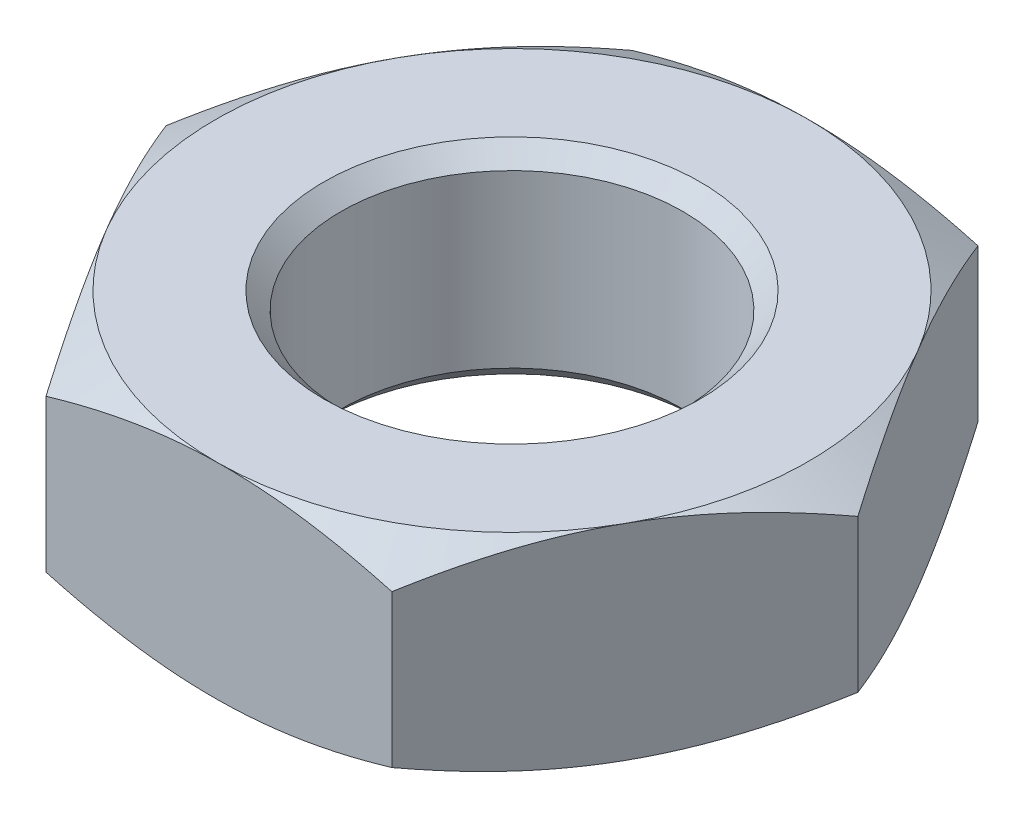
ISO-10303-21;
HEADER;
FILE_DESCRIPTION(('STEP AP214'),'2;1');
FILE_NAME('part.step','',(''),(''),'','','');
FILE_SCHEMA(('AUTOMOTIVE_DESIGN { 1 0 10303 214 1 1 1 1 }'));
ENDSEC;
DATA;
#1=APPLICATION_CONTEXT('core data for automotive mechanical design processes');
#2=APPLICATION_PROTOCOL_DEFINITION('international standard','automotive_design',2000,#1);
#3=PRODUCT_CONTEXT('',#1,'mechanical');
#4=PRODUCT('Part','Part','',(#3));
#5=PRODUCT_RELATED_PRODUCT_CATEGORY('part','',(#4));
#6=PRODUCT_DEFINITION_FORMATION('','',#4);
#7=PRODUCT_DEFINITION_CONTEXT('part definition',#1,'design');
#8=PRODUCT_DEFINITION('design','',#6,#7);
#9=PRODUCT_DEFINITION_SHAPE('','',#8);
#10=(LENGTH_UNIT() NAMED_UNIT(*) SI_UNIT(.MILLI.,.METRE.));
#11=(NAMED_UNIT(*) PLANE_ANGLE_UNIT() SI_UNIT($,.RADIAN.));
#12=(NAMED_UNIT(*) SI_UNIT($,.STERADIAN.) SOLID_ANGLE_UNIT());
#13=UNCERTAINTY_MEASURE_WITH_UNIT(LENGTH_MEASURE(1.E-05),#10,'distance_accuracy_value','');
#14=(GEOMETRIC_REPRESENTATION_CONTEXT(3) GLOBAL_UNCERTAINTY_ASSIGNED_CONTEXT((#13)) GLOBAL_UNIT_ASSIGNED_CONTEXT((#10,
#11,#12)) REPRESENTATION_CONTEXT('',''));
#15=CARTESIAN_POINT('',(0.,0.,0.));
#16=DIRECTION('',(0.,0.,1.));
#17=DIRECTION('',(1.,0.,0.));
#18=AXIS2_PLACEMENT_3D('',#15,#16,#17);
#19=CARTESIAN_POINT('',(0.,-3.,0.));
#20=DIRECTION('',(0.,1.,0.));
#21=DIRECTION('',(0.,0.,1.));
#22=AXIS2_PLACEMENT_3D('',#19,#20,#21);
#23=PLANE('',#22);
#24=CARTESIAN_POINT('',(0.,-3.,0.));
#25=DIRECTION('',(0.,1.,0.));
#26=DIRECTION('',(0.,0.,1.));
#27=AXIS2_PLACEMENT_3D('',#24,#25,#26);
#28=CIRCLE('',#27,5.5);
#29=CARTESIAN_POINT('',(0.,-3.,5.5));
#30=VERTEX_POINT('',#29);
#31=EDGE_CURVE('E333',#30,#30,#28,.T.);
#32=ORIENTED_EDGE('',*,*,#31,.T.);
#33=EDGE_LOOP('',(#32));
#34=FACE_BOUND('',#33,.T.);
#35=CARTESIAN_POINT('',(0.,-3.,0.));
#36=DIRECTION('',(0.,1.,0.));
#37=DIRECTION('',(0.,0.,1.));
#38=AXIS2_PLACEMENT_3D('',#35,#36,#37);
#39=CIRCLE('',#38,8.66076696360926);
#40=CARTESIAN_POINT('',(0.0942570843253592,-3.,8.66025403784439));
#41=VERTEX_POINT('',#40);
#42=CARTESIAN_POINT('',(-7.45287145783732,-3.,4.41175604843461));
#43=VERTEX_POINT('',#42);
#44=EDGE_CURVE('E50',#41,#43,#39,.F.);
#45=ORIENTED_EDGE('',*,*,#44,.T.);
#46=CARTESIAN_POINT('',(-7.54712854216268,-3.,-4.24849798940978));
#47=VERTEX_POINT('',#46);
#48=EDGE_CURVE('E12',#43,#47,#39,.F.);
#49=ORIENTED_EDGE('',*,*,#48,.T.);
#50=CARTESIAN_POINT('',(-0.0942570843253608,-3.,-8.66025403784439));
#51=VERTEX_POINT('',#50);
#52=EDGE_CURVE('E56',#47,#51,#39,.F.);
#53=ORIENTED_EDGE('',*,*,#52,.T.);
#54=CARTESIAN_POINT('',(7.45287145783732,-3.,-4.41175604843461));
#55=VERTEX_POINT('',#54);
#56=EDGE_CURVE('E429',#51,#55,#39,.F.);
#57=ORIENTED_EDGE('',*,*,#56,.T.);
#58=CARTESIAN_POINT('',(7.54712854216269,-3.,4.24849798940978));
#59=VERTEX_POINT('',#58);
#60=EDGE_CURVE('E156',#55,#59,#39,.F.);
#61=ORIENTED_EDGE('',*,*,#60,.T.);
#62=CARTESIAN_POINT('',(0.,-3.,0.));
#63=DIRECTION('',(0.,1.,0.));
#64=DIRECTION('',(0.,0.,1.));
#65=AXIS2_PLACEMENT_3D('',#62,#63,#64);
#66=CIRCLE('',#65,8.66076696360926);
#67=EDGE_CURVE('E138',#41,#59,#66,.T.);
#68=ORIENTED_EDGE('',*,*,#67,.F.);
#69=EDGE_LOOP('',(#45,#49,#53,#57,#61,#68));
#70=FACE_BOUND('',#69,.T.);
#71=ADVANCED_FACE('F45',(#34,#70),#23,.F.);
#72=CARTESIAN_POINT('',(0.,3.,0.));
#73=DIRECTION('',(0.,1.,0.));
#74=DIRECTION('',(0.,0.,1.));
#75=AXIS2_PLACEMENT_3D('',#72,#73,#74);
#76=PLANE('',#75);
#77=CARTESIAN_POINT('',(0.,3.,0.));
#78=DIRECTION('',(0.,1.,0.));
#79=DIRECTION('',(0.,0.,1.));
#80=AXIS2_PLACEMENT_3D('',#77,#78,#79);
#81=CIRCLE('',#80,5.50000000000001);
#82=CARTESIAN_POINT('',(0.,3.,5.50000000000001));
#83=VERTEX_POINT('',#82);
#84=EDGE_CURVE('E321',#83,#83,#81,.F.);
#85=ORIENTED_EDGE('',*,*,#84,.T.);
#86=EDGE_LOOP('',(#85));
#87=FACE_BOUND('',#86,.T.);
#88=CARTESIAN_POINT('',(0.,3.,0.));
#89=DIRECTION('',(0.,1.,0.));
#90=DIRECTION('',(0.,0.,1.));
#91=AXIS2_PLACEMENT_3D('',#88,#89,#90);
#92=CIRCLE('',#91,8.66076696360926);
#93=CARTESIAN_POINT('',(-7.45287145783732,3.,4.41175604843461));
#94=VERTEX_POINT('',#93);
#95=CARTESIAN_POINT('',(0.0942570843253596,3.,8.66025403784439));
#96=VERTEX_POINT('',#95);
#97=EDGE_CURVE('E372',#94,#96,#92,.T.);
#98=ORIENTED_EDGE('',*,*,#97,.T.);
#99=CARTESIAN_POINT('',(7.54712854216268,3.,4.24849798940978));
#100=VERTEX_POINT('',#99);
#101=EDGE_CURVE('E379',#96,#100,#92,.T.);
#102=ORIENTED_EDGE('',*,*,#101,.T.);
#103=CARTESIAN_POINT('',(7.45287145783732,3.,-4.41175604843461));
#104=VERTEX_POINT('',#103);
#105=EDGE_CURVE('E381',#100,#104,#92,.T.);
#106=ORIENTED_EDGE('',*,*,#105,.T.);
#107=CARTESIAN_POINT('',(-0.0942570843253608,3.,-8.66025403784439));
#108=VERTEX_POINT('',#107);
#109=EDGE_CURVE('E378',#104,#108,#92,.T.);
#110=ORIENTED_EDGE('',*,*,#109,.T.);
#111=CARTESIAN_POINT('',(-7.54712854216269,3.,-4.24849798940978));
#112=VERTEX_POINT('',#111);
#113=EDGE_CURVE('E374',#108,#112,#92,.T.);
#114=ORIENTED_EDGE('',*,*,#113,.T.);
#115=EDGE_CURVE('E364',#112,#94,#92,.T.);
#116=ORIENTED_EDGE('',*,*,#115,.T.);
#117=EDGE_LOOP('',(#98,#102,#106,#110,#114,#116));
#118=FACE_BOUND('',#117,.T.);
#119=ADVANCED_FACE('F282',(#87,#118),#76,.T.);
#120=CARTESIAN_POINT('',(-10.,3.,0.108838706016554));
#121=DIRECTION('',(0.86053250123837,0.,-0.50939553817484));
#122=DIRECTION('',(-0.50939553817484,0.,-0.86053250123837));
#123=AXIS2_PLACEMENT_3D('',#120,#121,#122);
#124=PLANE('',#123);
#125=DIRECTION('',(0.,-1.,0.));
#126=VECTOR('',#125,1.);
#127=CARTESIAN_POINT('',(-10.,3.,0.108838706016554));
#128=LINE('',#127,#126);
#129=CARTESIAN_POINT('',(-10.,2.22645149542226,0.108838706016554));
#130=VERTEX_POINT('',#129);
#131=CARTESIAN_POINT('',(-10.,-2.22645149542225,0.108838706016554));
#132=VERTEX_POINT('',#131);
#133=EDGE_CURVE('E277',#130,#132,#128,.T.);
#134=ORIENTED_EDGE('',*,*,#133,.T.);
#135=CARTESIAN_POINT('',(-10.0001183907726,-2.22638440204327,0.108638706016554));
#136=CARTESIAN_POINT('',(-9.88814110213187,-2.28983203273495,0.297804273938731));
#137=CARTESIAN_POINT('',(-9.77574632258918,-2.35040014745256,0.487675117944455));
#138=CARTESIAN_POINT('',(-9.55004397117362,-2.46498424836037,0.868958805066872));
#139=CARTESIAN_POINT('',(-9.43673602763207,-2.51899740634266,1.06037227605122));
#140=CARTESIAN_POINT('',(-9.094998008795,-2.67014413728017,1.63767743496915));
#141=CARTESIAN_POINT('',(-8.86521894371303,-2.75611435902254,2.02584799946934));
#142=CARTESIAN_POINT('',(-8.52135901523674,-2.85692446131623,2.60673774457305));
#143=CARTESIAN_POINT('',(-8.40830541729271,-2.88564232021194,2.79772154423755));
#144=CARTESIAN_POINT('',(-8.18168696359515,-2.93379724423381,3.18055282204155));
#145=CARTESIAN_POINT('',(-8.06812215390889,-2.95323512935884,3.37240022235866));
#146=CARTESIAN_POINT('',(-7.84079699725587,-2.98233748266303,3.75642534819689));
#147=CARTESIAN_POINT('',(-7.72703701962142,-2.99201304223366,3.94860244979726));
#148=CARTESIAN_POINT('',(-7.49941197874213,-3.00138331176437,4.33313417631015));
#149=CARTESIAN_POINT('',(-7.38554691885262,-3.00107833008348,4.52548879555447));
#150=CARTESIAN_POINT('',(-7.17267248824238,-2.99118175831376,4.88510200865617));
#151=CARTESIAN_POINT('',(-7.07364809455263,-2.98279741417697,5.05238598112828));
#152=CARTESIAN_POINT('',(-6.87583123342878,-2.95864295644428,5.3865621282142));
#153=CARTESIAN_POINT('',(-6.77703878207976,-2.94287234498285,5.55345427565516));
#154=CARTESIAN_POINT('',(-6.48104389429333,-2.88485388353617,6.05348460975126));
#155=CARTESIAN_POINT('',(-6.28436539272674,-2.83190665180059,6.38573770230745));
#156=CARTESIAN_POINT('',(-5.88892207452133,-2.69953781177264,7.0537683429616));
#157=CARTESIAN_POINT('',(-5.69020772609582,-2.61955509940705,7.38946063405479));
#158=CARTESIAN_POINT('',(-5.295742367997,-2.43802745253449,8.0558391863148));
#159=CARTESIAN_POINT('',(-5.09998630691196,-2.33652515384933,8.38653398093679));
#160=CARTESIAN_POINT('',(-4.90562452490208,-2.22638440204327,8.71487339085267));
#161=B_SPLINE_CURVE_WITH_KNOTS('',3,(#135,#136,#137,#138,#139,#140,#141,#142,#143,#144,#145,
#146,#147,#148,#149,#150,#151,#152,#153,#154,#155,#156,#157,#158,#159,#160),.UNSPECIFIED.,.F.,
.F.,(4,2,2,2,2,2,2,2,2,2,2,2,4),(0.,0.686336538275866,1.37296815902851,2.74908426772008,
3.42028917343918,4.09143475903671,4.76181696616375,5.4321784611661,6.01576281851993,
6.59938651757881,7.7674652493393,8.96144954263113,10.1530899914401),.UNSPECIFIED.);
#162=EDGE_CURVE('E65',#132,#43,#161,.T.);
#163=ORIENTED_EDGE('',*,*,#162,.T.);
#164=CARTESIAN_POINT('',(-4.90574291567464,-2.22645149542225,8.71467339085267));
#165=VERTEX_POINT('',#164);
#166=EDGE_CURVE('E153',#43,#165,#161,.T.);
#167=ORIENTED_EDGE('',*,*,#166,.T.);
#168=DIRECTION('',(0.,-1.,0.));
#169=VECTOR('',#168,1.);
#170=CARTESIAN_POINT('',(-4.90574291567464,3.,8.71467339085267));
#171=LINE('',#170,#169);
#172=CARTESIAN_POINT('',(-4.90574291567464,2.22645149542225,8.71467339085267));
#173=VERTEX_POINT('',#172);
#174=EDGE_CURVE('E167',#173,#165,#171,.T.);
#175=ORIENTED_EDGE('',*,*,#174,.F.);
#176=CARTESIAN_POINT('',(-10.0001183907726,2.22638440204327,0.108638706016554));
#177=CARTESIAN_POINT('',(-9.88814110213187,2.28983203273495,0.297804273938731));
#178=CARTESIAN_POINT('',(-9.77574632258918,2.35040014745256,0.487675117944455));
#179=CARTESIAN_POINT('',(-9.55004397117362,2.46498424836037,0.868958805066872));
#180=CARTESIAN_POINT('',(-9.43673602763207,2.51899740634266,1.06037227605122));
#181=CARTESIAN_POINT('',(-9.094998008795,2.67014413728017,1.63767743496915));
#182=CARTESIAN_POINT('',(-8.86521894371303,2.75611435902254,2.02584799946934));
#183=CARTESIAN_POINT('',(-8.52135901523674,2.85692446131623,2.60673774457305));
#184=CARTESIAN_POINT('',(-8.40830541729271,2.88564232021194,2.79772154423755));
#185=CARTESIAN_POINT('',(-8.18168696359515,2.93379724423381,3.18055282204155));
#186=CARTESIAN_POINT('',(-8.06812215390889,2.95323512935884,3.37240022235866));
#187=CARTESIAN_POINT('',(-7.84079699725587,2.98233748266303,3.75642534819689));
#188=CARTESIAN_POINT('',(-7.72703701962142,2.99201304223366,3.94860244979726));
#189=CARTESIAN_POINT('',(-7.49941197874213,3.00138331176437,4.33313417631015));
#190=CARTESIAN_POINT('',(-7.38554691885262,3.00107833008348,4.52548879555447));
#191=CARTESIAN_POINT('',(-7.17267248824238,2.99118175831376,4.88510200865617));
#192=CARTESIAN_POINT('',(-7.07364809455263,2.98279741417697,5.05238598112828));
#193=CARTESIAN_POINT('',(-6.87583123342878,2.95864295644428,5.3865621282142));
#194=CARTESIAN_POINT('',(-6.77703878207976,2.94287234498285,5.55345427565516));
#195=CARTESIAN_POINT('',(-6.48104389429333,2.88485388353617,6.05348460975126));
#196=CARTESIAN_POINT('',(-6.28436539272674,2.83190665180059,6.38573770230745));
#197=CARTESIAN_POINT('',(-5.88892207452133,2.69953781177264,7.0537683429616));
#198=CARTESIAN_POINT('',(-5.69020772609582,2.61955509940705,7.38946063405479));
#199=CARTESIAN_POINT('',(-5.295742367997,2.43802745253449,8.0558391863148));
#200=CARTESIAN_POINT('',(-5.09998630691196,2.33652515384933,8.38653398093679));
#201=CARTESIAN_POINT('',(-4.90562452490208,2.22638440204327,8.71487339085267));
#202=B_SPLINE_CURVE_WITH_KNOTS('',3,(#176,#177,#178,#179,#180,#181,#182,#183,#184,#185,#186,
#187,#188,#189,#190,#191,#192,#193,#194,#195,#196,#197,#198,#199,#200,#201),.UNSPECIFIED.,.F.,
.F.,(4,2,2,2,2,2,2,2,2,2,2,2,4),(0.,0.686336538275866,1.37296815902851,2.74908426772008,
3.42028917343918,4.09143475903671,4.76181696616375,5.4321784611661,6.01576281851993,
6.59938651757881,7.7674652493393,8.96144954263113,10.1530899914401),.UNSPECIFIED.);
#203=EDGE_CURVE('E269',#94,#173,#202,.T.);
#204=ORIENTED_EDGE('',*,*,#203,.F.);
#205=EDGE_CURVE('E276',#130,#94,#202,.T.);
#206=ORIENTED_EDGE('',*,*,#205,.F.);
#207=EDGE_LOOP('',(#134,#163,#167,#175,#204,#206));
#208=FACE_BOUND('',#207,.T.);
#209=ADVANCED_FACE('F279',(#208),#124,.F.);
#210=CARTESIAN_POINT('',(-4.90574291567464,3.,8.71467339085267));
#211=DIRECTION('',(-0.0108832260146714,0.,-0.999940775942012));
#212=DIRECTION('',(-0.999940775942012,0.,0.0108832260146714));
#213=AXIS2_PLACEMENT_3D('',#210,#211,#212);
#214=PLANE('',#213);
#215=ORIENTED_EDGE('',*,*,#174,.T.);
#216=CARTESIAN_POINT('',(-4.90594291567464,-2.22639375610976,8.71467556762679));
#217=CARTESIAN_POINT('',(-4.68613235682235,-2.28984099979788,8.71228317794736));
#218=CARTESIAN_POINT('',(-4.46550226685225,-2.35040871815305,8.70988186859729));
#219=CARTESIAN_POINT('',(-4.02245028601828,-2.46499200912856,8.70505974816809));
#220=CARTESIAN_POINT('',(-3.80002766557353,-2.51900475353539,8.70263892914829));
#221=CARTESIAN_POINT('',(-3.129198594288,-2.67015021487161,8.69533771234059));
#222=CARTESIAN_POINT('',(-2.67814409640502,-2.75611955868799,8.69042849355133));
#223=CARTESIAN_POINT('',(-2.00314976677657,-2.85692835280127,8.68308194261081));
#224=CARTESIAN_POINT('',(-1.78122642744935,-2.8856457838232,8.68066655770208));
#225=CARTESIAN_POINT('',(-1.33637616922279,-2.93379985618771,8.67582486505443));
#226=CARTESIAN_POINT('',(-1.11344934075141,-2.95323731752561,8.67339855829971));
#227=CARTESIAN_POINT('',(-0.667211859734305,-2.98233883822514,8.66854176729871));
#228=CARTESIAN_POINT('',(-0.443901932154915,-2.99201398880795,8.66611129094287));
#229=CARTESIAN_POINT('',(0.00292418729655811,-3.0013834651085,8.66124809327732));
#230=CARTESIAN_POINT('',(0.226440372582448,-3.00107809919763,8.6588153720393));
#231=CARTESIAN_POINT('',(0.644309028018933,-2.99118089124642,8.65426734366504));
#232=CARTESIAN_POINT('',(0.838690992183547,-2.98279637261485,8.65215171551978));
#233=CARTESIAN_POINT('',(1.2269996532959,-2.95864175478961,8.64792541429873));
#234=CARTESIAN_POINT('',(1.42092631867015,-2.94287115776235,8.64581474156658));
#235=CARTESIAN_POINT('',(2.00195553945785,-2.88485301436794,8.63949089471175));
#236=CARTESIAN_POINT('',(2.3880296321027,-2.8319063610758,8.63528891424475));
#237=CARTESIAN_POINT('',(3.16427310822953,-2.69953932800701,8.62684038069521));
#238=CARTESIAN_POINT('',(3.5543434271682,-2.61955786742564,8.62259490581833));
#239=CARTESIAN_POINT('',(4.3286672130881,-2.43803319971361,8.6141672659286));
#240=CARTESIAN_POINT('',(4.71293059537731,-2.3365326260426,8.60998499299881));
#241=CARTESIAN_POINT('',(5.09445708432536,-2.22639375610976,8.60583250806199));
#242=B_SPLINE_CURVE_WITH_KNOTS('',3,(#216,#217,#218,#219,#220,#221,#222,#223,#224,#225,#226,
#227,#228,#229,#230,#231,#232,#233,#234,#235,#236,#237,#238,#239,#240,#241),.UNSPECIFIED.,.F.,
.F.,(4,2,2,2,2,2,2,2,2,2,2,2,4),(0.,0.686335429763832,1.37296594134944,2.74907977068818,
3.42028367297772,4.09142825546413,4.76180947123174,5.4321699740245,6.01574715867536,
6.59936368302952,7.76742802144234,8.96139715984838,10.1530225612281),.UNSPECIFIED.);
#243=EDGE_CURVE('E147',#165,#41,#242,.T.);
#244=ORIENTED_EDGE('',*,*,#243,.T.);
#245=CARTESIAN_POINT('',(5.09425708432536,-2.22645149542225,8.60583468483611));
#246=VERTEX_POINT('',#245);
#247=EDGE_CURVE('E134',#41,#246,#242,.T.);
#248=ORIENTED_EDGE('',*,*,#247,.T.);
#249=DIRECTION('',(0.,-1.,0.));
#250=VECTOR('',#249,1.);
#251=CARTESIAN_POINT('',(5.09425708432536,3.,8.60583468483611));
#252=LINE('',#251,#250);
#253=CARTESIAN_POINT('',(5.09425708432536,2.22645149542225,8.60583468483611));
#254=VERTEX_POINT('',#253);
#255=EDGE_CURVE('E338',#254,#246,#252,.T.);
#256=ORIENTED_EDGE('',*,*,#255,.F.);
#257=CARTESIAN_POINT('',(-4.90594291567464,2.22639375610976,8.71467556762679));
#258=CARTESIAN_POINT('',(-4.68613235682235,2.28984099979788,8.71228317794736));
#259=CARTESIAN_POINT('',(-4.46550226685225,2.35040871815305,8.70988186859729));
#260=CARTESIAN_POINT('',(-4.02245028601828,2.46499200912856,8.70505974816809));
#261=CARTESIAN_POINT('',(-3.80002766557353,2.51900475353539,8.70263892914829));
#262=CARTESIAN_POINT('',(-3.129198594288,2.67015021487161,8.69533771234059));
#263=CARTESIAN_POINT('',(-2.67814409640502,2.75611955868799,8.69042849355133));
#264=CARTESIAN_POINT('',(-2.00314976677657,2.85692835280127,8.68308194261081));
#265=CARTESIAN_POINT('',(-1.78122642744935,2.8856457838232,8.68066655770208));
#266=CARTESIAN_POINT('',(-1.33637616922279,2.93379985618771,8.67582486505443));
#267=CARTESIAN_POINT('',(-1.11344934075141,2.95323731752561,8.67339855829971));
#268=CARTESIAN_POINT('',(-0.667211859734305,2.98233883822514,8.66854176729871));
#269=CARTESIAN_POINT('',(-0.443901932154915,2.99201398880795,8.66611129094287));
#270=CARTESIAN_POINT('',(0.00292418729655811,3.0013834651085,8.66124809327732));
#271=CARTESIAN_POINT('',(0.226440372582448,3.00107809919763,8.6588153720393));
#272=CARTESIAN_POINT('',(0.644309028018933,2.99118089124642,8.65426734366504));
#273=CARTESIAN_POINT('',(0.838690992183547,2.98279637261485,8.65215171551978));
#274=CARTESIAN_POINT('',(1.2269996532959,2.95864175478961,8.64792541429873));
#275=CARTESIAN_POINT('',(1.42092631867015,2.94287115776235,8.64581474156658));
#276=CARTESIAN_POINT('',(2.00195553945785,2.88485301436794,8.63949089471175));
#277=CARTESIAN_POINT('',(2.3880296321027,2.8319063610758,8.63528891424475));
#278=CARTESIAN_POINT('',(3.16427310822953,2.69953932800701,8.62684038069521));
#279=CARTESIAN_POINT('',(3.5543434271682,2.61955786742564,8.62259490581833));
#280=CARTESIAN_POINT('',(4.3286672130881,2.43803319971361,8.6141672659286));
#281=CARTESIAN_POINT('',(4.71293059537731,2.3365326260426,8.60998499299881));
#282=CARTESIAN_POINT('',(5.09445708432536,2.22639375610976,8.60583250806199));
#283=B_SPLINE_CURVE_WITH_KNOTS('',3,(#257,#258,#259,#260,#261,#262,#263,#264,#265,#266,#267,
#268,#269,#270,#271,#272,#273,#274,#275,#276,#277,#278,#279,#280,#281,#282),.UNSPECIFIED.,.F.,
.F.,(4,2,2,2,2,2,2,2,2,2,2,2,4),(0.,0.686335429763832,1.37296594134944,2.74907977068818,
3.42028367297772,4.09142825546413,4.76180947123174,5.4321699740245,6.01574715867536,
6.59936368302952,7.76742802144234,8.96139715984838,10.1530225612281),.UNSPECIFIED.);
#284=EDGE_CURVE('E261',#96,#254,#283,.T.);
#285=ORIENTED_EDGE('',*,*,#284,.F.);
#286=EDGE_CURVE('E268',#173,#96,#283,.T.);
#287=ORIENTED_EDGE('',*,*,#286,.F.);
#288=EDGE_LOOP('',(#215,#244,#248,#256,#285,#287));
#289=FACE_BOUND('',#288,.T.);
#290=ADVANCED_FACE('F164',(#289),#214,.F.);
#291=CARTESIAN_POINT('',(5.09425708432536,3.,8.60583468483611));
#292=DIRECTION('',(-0.871415727253042,0.,-0.490545237767172));
#293=DIRECTION('',(-0.490545237767172,0.,0.871415727253042));
#294=AXIS2_PLACEMENT_3D('',#291,#292,#293);
#295=PLANE('',#294);
#296=ORIENTED_EDGE('',*,*,#255,.T.);
#297=CARTESIAN_POINT('',(5.094144498513,-2.22638523999576,8.60603468483612));
#298=CARTESIAN_POINT('',(5.20197802954554,-2.28983283601912,8.41447674556287));
#299=CARTESIAN_POINT('',(5.31021360207331,-2.35040091523003,8.22220461062534));
#300=CARTESIAN_POINT('',(5.52756376111711,-2.46498494358297,7.83609884029144));
#301=CARTESIAN_POINT('',(5.63667870554802,-2.51899806451659,7.64226456908694));
#302=CARTESIAN_POINT('',(5.96577059118928,-2.67014468172144,7.05765825191124));
#303=CARTESIAN_POINT('',(6.18704660194046,-2.75611482481796,6.66457850923537));
#304=CARTESIAN_POINT('',(6.51818187373942,-2.85692480992297,6.07634227437299));
#305=CARTESIAN_POINT('',(6.62705188460117,-2.88564263048914,5.88294310873648));
#306=CARTESIAN_POINT('',(6.84528424418022,-2.93379747821832,5.49527017728916));
#307=CARTESIAN_POINT('',(6.95464654853507,-2.95323532537988,5.30099649028481));
#308=CARTESIAN_POINT('',(7.17355945798181,-2.98233760409811,4.91211461456034));
#309=CARTESIAN_POINT('',(7.28310970740997,-2.99201312703101,4.71750705764933));
#310=CARTESIAN_POINT('',(7.50231140235893,-3.00138332550298,4.32811217678474));
#311=CARTESIAN_POINT('',(7.61196284464858,-3.00107830940219,4.13332485857102));
#312=CARTESIAN_POINT('',(7.81695968710314,-2.99118168064206,3.76916380103994));
#313=CARTESIAN_POINT('',(7.9123195544846,-2.9827973208735,3.59976436182981));
#314=CARTESIAN_POINT('',(8.10281594560036,-2.95864284879903,3.26136223614856));
#315=CARTESIAN_POINT('',(8.19795245384489,-2.94287223863046,3.09235957719386));
#316=CARTESIAN_POINT('',(8.48299366574364,-2.88485380567495,2.5860058796339));
#317=CARTESIAN_POINT('',(8.67239382367805,-2.83190662575707,2.2495511275309));
#318=CARTESIAN_POINT('',(9.0532032441234,-2.69953794759926,1.57307260421947));
#319=CARTESIAN_POINT('',(9.24456390619776,-2.61955534737055,1.23313516793291));
#320=CARTESIAN_POINT('',(9.62443155795169,-2.43802796737609,0.558329623963553));
#321=CARTESIAN_POINT('',(9.81294341208854,-2.33652582322055,0.223452874948095));
#322=CARTESIAN_POINT('',(10.0001125858124,-2.22638523999576,-0.109038706016554));
#323=B_SPLINE_CURVE_WITH_KNOTS('',3,(#297,#298,#299,#300,#301,#302,#303,#304,#305,#306,#307,
#308,#309,#310,#311,#312,#313,#314,#315,#316,#317,#318,#319,#320,#321,#322),.UNSPECIFIED.,.F.,
.F.,(4,2,2,2,2,2,2,2,2,2,2,2,4),(0.,0.686336438973568,1.37296796036524,2.74908386486871,
3.42028868069895,4.09143417643615,4.7618162947556,5.4321777008742,6.01576141568727,
6.59938447202606,7.76746191441029,8.96144485010566,10.1530839509444),.UNSPECIFIED.);
#324=EDGE_CURVE('E141',#246,#59,#323,.T.);
#325=ORIENTED_EDGE('',*,*,#324,.T.);
#326=CARTESIAN_POINT('',(10.,-2.22645149542226,-0.108838706016554));
#327=VERTEX_POINT('',#326);
#328=EDGE_CURVE('E178',#59,#327,#323,.T.);
#329=ORIENTED_EDGE('',*,*,#328,.T.);
#330=DIRECTION('',(0.,-1.,0.));
#331=VECTOR('',#330,1.);
#332=CARTESIAN_POINT('',(10.,3.,-0.108838706016554));
#333=LINE('',#332,#331);
#334=CARTESIAN_POINT('',(10.,2.22645149542226,-0.108838706016554));
#335=VERTEX_POINT('',#334);
#336=EDGE_CURVE('E341',#335,#327,#333,.T.);
#337=ORIENTED_EDGE('',*,*,#336,.F.);
#338=CARTESIAN_POINT('',(5.094144498513,2.22638523999576,8.60603468483612));
#339=CARTESIAN_POINT('',(5.20197802954554,2.28983283601912,8.41447674556287));
#340=CARTESIAN_POINT('',(5.31021360207331,2.35040091523003,8.22220461062534));
#341=CARTESIAN_POINT('',(5.52756376111711,2.46498494358297,7.83609884029144));
#342=CARTESIAN_POINT('',(5.63667870554802,2.51899806451659,7.64226456908694));
#343=CARTESIAN_POINT('',(5.96577059118928,2.67014468172144,7.05765825191124));
#344=CARTESIAN_POINT('',(6.18704660194046,2.75611482481796,6.66457850923537));
#345=CARTESIAN_POINT('',(6.51818187373942,2.85692480992297,6.07634227437299));
#346=CARTESIAN_POINT('',(6.62705188460117,2.88564263048914,5.88294310873648));
#347=CARTESIAN_POINT('',(6.84528424418022,2.93379747821832,5.49527017728916));
#348=CARTESIAN_POINT('',(6.95464654853507,2.95323532537988,5.30099649028481));
#349=CARTESIAN_POINT('',(7.17355945798181,2.98233760409811,4.91211461456034));
#350=CARTESIAN_POINT('',(7.28310970740997,2.99201312703101,4.71750705764933));
#351=CARTESIAN_POINT('',(7.50231140235893,3.00138332550298,4.32811217678474));
#352=CARTESIAN_POINT('',(7.61196284464858,3.00107830940219,4.13332485857102));
#353=CARTESIAN_POINT('',(7.81695968710314,2.99118168064206,3.76916380103994));
#354=CARTESIAN_POINT('',(7.9123195544846,2.9827973208735,3.59976436182981));
#355=CARTESIAN_POINT('',(8.10281594560036,2.95864284879903,3.26136223614856));
#356=CARTESIAN_POINT('',(8.19795245384489,2.94287223863046,3.09235957719386));
#357=CARTESIAN_POINT('',(8.48299366574364,2.88485380567495,2.5860058796339));
#358=CARTESIAN_POINT('',(8.67239382367805,2.83190662575707,2.2495511275309));
#359=CARTESIAN_POINT('',(9.0532032441234,2.69953794759926,1.57307260421947));
#360=CARTESIAN_POINT('',(9.24456390619776,2.61955534737055,1.23313516793291));
#361=CARTESIAN_POINT('',(9.62443155795169,2.43802796737609,0.558329623963553));
#362=CARTESIAN_POINT('',(9.81294341208854,2.33652582322055,0.223452874948095));
#363=CARTESIAN_POINT('',(10.0001125858124,2.22638523999576,-0.109038706016554));
#364=B_SPLINE_CURVE_WITH_KNOTS('',3,(#338,#339,#340,#341,#342,#343,#344,#345,#346,#347,#348,
#349,#350,#351,#352,#353,#354,#355,#356,#357,#358,#359,#360,#361,#362,#363),.UNSPECIFIED.,.F.,
.F.,(4,2,2,2,2,2,2,2,2,2,2,2,4),(0.,0.686336438973568,1.37296796036524,2.74908386486871,
3.42028868069895,4.09143417643615,4.7618162947556,5.4321777008742,6.01576141568727,
6.59938447202606,7.76746191441029,8.96144485010566,10.1530839509444),.UNSPECIFIED.);
#365=EDGE_CURVE('E253',#100,#335,#364,.T.);
#366=ORIENTED_EDGE('',*,*,#365,.F.);
#367=EDGE_CURVE('E260',#254,#100,#364,.T.);
#368=ORIENTED_EDGE('',*,*,#367,.F.);
#369=EDGE_LOOP('',(#296,#325,#329,#337,#366,#368));
#370=FACE_BOUND('',#369,.T.);
#371=ADVANCED_FACE('F232',(#370),#295,.F.);
#372=CARTESIAN_POINT('',(10.,3.,-0.108838706016554));
#373=DIRECTION('',(-0.86053250123837,0.,0.50939553817484));
#374=DIRECTION('',(0.50939553817484,0.,0.86053250123837));
#375=AXIS2_PLACEMENT_3D('',#372,#373,#374);
#376=PLANE('',#375);
#377=ORIENTED_EDGE('',*,*,#336,.T.);
#378=CARTESIAN_POINT('',(10.0001183907726,-2.22638440204328,-0.108638706016554));
#379=CARTESIAN_POINT('',(9.88814110213186,-2.28983203273495,-0.297804273938731));
#380=CARTESIAN_POINT('',(9.77574632258917,-2.35040014745256,-0.487675117944455));
#381=CARTESIAN_POINT('',(9.55004397117362,-2.46498424836037,-0.868958805066871));
#382=CARTESIAN_POINT('',(9.43673602763207,-2.51899740634266,-1.06037227605122));
#383=CARTESIAN_POINT('',(9.09499800879499,-2.67014413728017,-1.63767743496915));
#384=CARTESIAN_POINT('',(8.86521894371302,-2.75611435902254,-2.02584799946934));
#385=CARTESIAN_POINT('',(8.52135901523673,-2.85692446131623,-2.60673774457305));
#386=CARTESIAN_POINT('',(8.4083054172927,-2.88564232021194,-2.79772154423755));
#387=CARTESIAN_POINT('',(8.18168696359514,-2.93379724423382,-3.18055282204155));
#388=CARTESIAN_POINT('',(8.06812215390888,-2.95323512935884,-3.37240022235866));
#389=CARTESIAN_POINT('',(7.84079699725587,-2.98233748266303,-3.75642534819689));
#390=CARTESIAN_POINT('',(7.72703701962141,-2.99201304223366,-3.94860244979725));
#391=CARTESIAN_POINT('',(7.49941197874213,-3.00138331176437,-4.33313417631014));
#392=CARTESIAN_POINT('',(7.38554691885262,-3.00107833008349,-4.52548879555447));
#393=CARTESIAN_POINT('',(7.17267248824238,-2.99118175831376,-4.88510200865617));
#394=CARTESIAN_POINT('',(7.07364809455263,-2.98279741417697,-5.05238598112827));
#395=CARTESIAN_POINT('',(6.87583123342878,-2.95864295644428,-5.3865621282142));
#396=CARTESIAN_POINT('',(6.77703878207976,-2.94287234498286,-5.55345427565516));
#397=CARTESIAN_POINT('',(6.48104389429333,-2.88485388353617,-6.05348460975126));
#398=CARTESIAN_POINT('',(6.28436539272674,-2.83190665180059,-6.38573770230745));
#399=CARTESIAN_POINT('',(5.88892207452132,-2.69953781177264,-7.0537683429616));
#400=CARTESIAN_POINT('',(5.69020772609581,-2.61955509940705,-7.38946063405479));
#401=CARTESIAN_POINT('',(5.295742367997,-2.43802745253449,-8.05583918631481));
#402=CARTESIAN_POINT('',(5.09998630691195,-2.33652515384933,-8.3865339809368));
#403=CARTESIAN_POINT('',(4.90562452490207,-2.22638440204327,-8.71487339085267));
#404=B_SPLINE_CURVE_WITH_KNOTS('',3,(#378,#379,#380,#381,#382,#383,#384,#385,#386,#387,#388,
#389,#390,#391,#392,#393,#394,#395,#396,#397,#398,#399,#400,#401,#402,#403),.UNSPECIFIED.,.F.,
.F.,(4,2,2,2,2,2,2,2,2,2,2,2,4),(0.,0.686336538275865,1.37296815902851,2.74908426772008,
3.42028917343918,4.0914347590367,4.76181696616375,5.4321784611661,6.01576281851993,
6.59938651757881,7.7674652493393,8.96144954263113,10.1530899914401),.UNSPECIFIED.);
#405=EDGE_CURVE('E226',#327,#55,#404,.T.);
#406=ORIENTED_EDGE('',*,*,#405,.T.);
#407=CARTESIAN_POINT('',(4.90574291567463,-2.22645149542226,-8.71467339085267));
#408=VERTEX_POINT('',#407);
#409=EDGE_CURVE('E218',#55,#408,#404,.T.);
#410=ORIENTED_EDGE('',*,*,#409,.T.);
#411=DIRECTION('',(0.,-1.,0.));
#412=VECTOR('',#411,1.);
#413=CARTESIAN_POINT('',(4.90574291567463,3.,-8.71467339085267));
#414=LINE('',#413,#412);
#415=CARTESIAN_POINT('',(4.90574291567463,2.22645149542226,-8.71467339085267));
#416=VERTEX_POINT('',#415);
#417=EDGE_CURVE('E345',#416,#408,#414,.T.);
#418=ORIENTED_EDGE('',*,*,#417,.F.);
#419=CARTESIAN_POINT('',(10.0001183907726,2.22638440204328,-0.108638706016554));
#420=CARTESIAN_POINT('',(9.88814110213186,2.28983203273495,-0.297804273938731));
#421=CARTESIAN_POINT('',(9.77574632258917,2.35040014745256,-0.487675117944455));
#422=CARTESIAN_POINT('',(9.55004397117362,2.46498424836037,-0.868958805066871));
#423=CARTESIAN_POINT('',(9.43673602763207,2.51899740634266,-1.06037227605122));
#424=CARTESIAN_POINT('',(9.09499800879499,2.67014413728017,-1.63767743496915));
#425=CARTESIAN_POINT('',(8.86521894371302,2.75611435902254,-2.02584799946934));
#426=CARTESIAN_POINT('',(8.52135901523673,2.85692446131623,-2.60673774457305));
#427=CARTESIAN_POINT('',(8.4083054172927,2.88564232021194,-2.79772154423755));
#428=CARTESIAN_POINT('',(8.18168696359514,2.93379724423382,-3.18055282204155));
#429=CARTESIAN_POINT('',(8.06812215390888,2.95323512935884,-3.37240022235866));
#430=CARTESIAN_POINT('',(7.84079699725587,2.98233748266303,-3.75642534819689));
#431=CARTESIAN_POINT('',(7.72703701962141,2.99201304223366,-3.94860244979725));
#432=CARTESIAN_POINT('',(7.49941197874213,3.00138331176437,-4.33313417631014));
#433=CARTESIAN_POINT('',(7.38554691885262,3.00107833008349,-4.52548879555447));
#434=CARTESIAN_POINT('',(7.17267248824238,2.99118175831376,-4.88510200865617));
#435=CARTESIAN_POINT('',(7.07364809455263,2.98279741417697,-5.05238598112827));
#436=CARTESIAN_POINT('',(6.87583123342878,2.95864295644428,-5.3865621282142));
#437=CARTESIAN_POINT('',(6.77703878207976,2.94287234498286,-5.55345427565516));
#438=CARTESIAN_POINT('',(6.48104389429333,2.88485388353617,-6.05348460975126));
#439=CARTESIAN_POINT('',(6.28436539272674,2.83190665180059,-6.38573770230745));
#440=CARTESIAN_POINT('',(5.88892207452132,2.69953781177264,-7.0537683429616));
#441=CARTESIAN_POINT('',(5.69020772609581,2.61955509940705,-7.38946063405479));
#442=CARTESIAN_POINT('',(5.295742367997,2.43802745253449,-8.05583918631481));
#443=CARTESIAN_POINT('',(5.09998630691195,2.33652515384933,-8.3865339809368));
#444=CARTESIAN_POINT('',(4.90562452490207,2.22638440204327,-8.71487339085267));
#445=B_SPLINE_CURVE_WITH_KNOTS('',3,(#419,#420,#421,#422,#423,#424,#425,#426,#427,#428,#429,
#430,#431,#432,#433,#434,#435,#436,#437,#438,#439,#440,#441,#442,#443,#444),.UNSPECIFIED.,.F.,
.F.,(4,2,2,2,2,2,2,2,2,2,2,2,4),(0.,0.686336538275865,1.37296815902851,2.74908426772008,
3.42028917343918,4.0914347590367,4.76181696616375,5.4321784611661,6.01576281851993,
6.59938651757881,7.7674652493393,8.96144954263113,10.1530899914401),.UNSPECIFIED.);
#446=EDGE_CURVE('E238',#104,#416,#445,.T.);
#447=ORIENTED_EDGE('',*,*,#446,.F.);
#448=EDGE_CURVE('E246',#335,#104,#445,.T.);
#449=ORIENTED_EDGE('',*,*,#448,.F.);
#450=EDGE_LOOP('',(#377,#406,#410,#418,#447,#449));
#451=FACE_BOUND('',#450,.T.);
#452=ADVANCED_FACE('F228',(#451),#376,.F.);
#453=CARTESIAN_POINT('',(4.90574291567463,3.,-8.71467339085267));
#454=DIRECTION('',(0.0108832260146716,0.,0.999940775942012));
#455=DIRECTION('',(0.999940775942012,0.,-0.0108832260146716));
#456=AXIS2_PLACEMENT_3D('',#453,#454,#455);
#457=PLANE('',#456);
#458=ORIENTED_EDGE('',*,*,#417,.T.);
#459=CARTESIAN_POINT('',(4.90594291567463,-2.22639375610976,-8.71467556762679));
#460=CARTESIAN_POINT('',(4.68613235682234,-2.28984099979788,-8.71228317794736));
#461=CARTESIAN_POINT('',(4.46550226685224,-2.35040871815305,-8.7098818685973));
#462=CARTESIAN_POINT('',(4.02245028601827,-2.46499200912856,-8.70505974816809));
#463=CARTESIAN_POINT('',(3.80002766557352,-2.51900475353539,-8.70263892914829));
#464=CARTESIAN_POINT('',(3.129198594288,-2.67015021487161,-8.69533771234059));
#465=CARTESIAN_POINT('',(2.67814409640501,-2.75611955868799,-8.69042849355134));
#466=CARTESIAN_POINT('',(2.00314976677656,-2.85692835280127,-8.68308194261081));
#467=CARTESIAN_POINT('',(1.78122642744934,-2.8856457838232,-8.68066655770209));
#468=CARTESIAN_POINT('',(1.33637616922278,-2.93379985618771,-8.67582486505443));
#469=CARTESIAN_POINT('',(1.1134493407514,-2.95323731752561,-8.67339855829971));
#470=CARTESIAN_POINT('',(0.667211859734296,-2.98233883822514,-8.66854176729872));
#471=CARTESIAN_POINT('',(0.443901932154906,-2.99201398880795,-8.66611129094288));
#472=CARTESIAN_POINT('',(-0.00292418729656664,-3.0013834651085,-8.66124809327733));
#473=CARTESIAN_POINT('',(-0.226440372582457,-3.00107809919763,-8.6588153720393));
#474=CARTESIAN_POINT('',(-0.644309028018941,-2.99118089124642,-8.65426734366504));
#475=CARTESIAN_POINT('',(-0.838690992183554,-2.98279637261485,-8.65215171551978));
#476=CARTESIAN_POINT('',(-1.22699965329591,-2.9586417547896,-8.64792541429873));
#477=CARTESIAN_POINT('',(-1.42092631867016,-2.94287115776235,-8.64581474156659));
#478=CARTESIAN_POINT('',(-2.00195553945786,-2.88485301436794,-8.63949089471175));
#479=CARTESIAN_POINT('',(-2.3880296321027,-2.8319063610758,-8.63528891424475));
#480=CARTESIAN_POINT('',(-3.16427310822954,-2.69953932800701,-8.62684038069521));
#481=CARTESIAN_POINT('',(-3.5543434271682,-2.61955786742564,-8.62259490581834));
#482=CARTESIAN_POINT('',(-4.3286672130881,-2.43803319971361,-8.6141672659286));
#483=CARTESIAN_POINT('',(-4.71293059537731,-2.33653262604259,-8.60998499299881));
#484=CARTESIAN_POINT('',(-5.09445708432536,-2.22639375610976,-8.605832508062));
#485=B_SPLINE_CURVE_WITH_KNOTS('',3,(#459,#460,#461,#462,#463,#464,#465,#466,#467,#468,#469,
#470,#471,#472,#473,#474,#475,#476,#477,#478,#479,#480,#481,#482,#483,#484),.UNSPECIFIED.,.F.,
.F.,(4,2,2,2,2,2,2,2,2,2,2,2,4),(0.,0.686335429763832,1.37296594134944,2.74907977068818,
3.42028367297772,4.09142825546413,4.76180947123174,5.4321699740245,6.01574715867536,
6.59936368302952,7.76742802144234,8.96139715984837,10.1530225612281),.UNSPECIFIED.);
#486=EDGE_CURVE('E227',#408,#51,#485,.T.);
#487=ORIENTED_EDGE('',*,*,#486,.T.);
#488=CARTESIAN_POINT('',(-5.09425708432536,-2.22645149542225,-8.60583468483612));
#489=VERTEX_POINT('',#488);
#490=EDGE_CURVE('E212',#51,#489,#485,.T.);
#491=ORIENTED_EDGE('',*,*,#490,.T.);
#492=DIRECTION('',(0.,-1.,0.));
#493=VECTOR('',#492,1.);
#494=CARTESIAN_POINT('',(-5.09425708432536,3.,-8.60583468483612));
#495=LINE('',#494,#493);
#496=CARTESIAN_POINT('',(-5.09425708432536,2.22645149542225,-8.60583468483612));
#497=VERTEX_POINT('',#496);
#498=EDGE_CURVE('E348',#497,#489,#495,.T.);
#499=ORIENTED_EDGE('',*,*,#498,.F.);
#500=CARTESIAN_POINT('',(4.90594291567463,2.22639375610976,-8.71467556762679));
#501=CARTESIAN_POINT('',(4.68613235682234,2.28984099979788,-8.71228317794736));
#502=CARTESIAN_POINT('',(4.46550226685224,2.35040871815305,-8.7098818685973));
#503=CARTESIAN_POINT('',(4.02245028601827,2.46499200912856,-8.70505974816809));
#504=CARTESIAN_POINT('',(3.80002766557352,2.51900475353539,-8.70263892914829));
#505=CARTESIAN_POINT('',(3.129198594288,2.67015021487161,-8.69533771234059));
#506=CARTESIAN_POINT('',(2.67814409640501,2.75611955868799,-8.69042849355134));
#507=CARTESIAN_POINT('',(2.00314976677656,2.85692835280127,-8.68308194261081));
#508=CARTESIAN_POINT('',(1.78122642744934,2.8856457838232,-8.68066655770209));
#509=CARTESIAN_POINT('',(1.33637616922278,2.93379985618771,-8.67582486505443));
#510=CARTESIAN_POINT('',(1.1134493407514,2.95323731752561,-8.67339855829971));
#511=CARTESIAN_POINT('',(0.667211859734296,2.98233883822514,-8.66854176729872));
#512=CARTESIAN_POINT('',(0.443901932154906,2.99201398880795,-8.66611129094288));
#513=CARTESIAN_POINT('',(-0.00292418729656664,3.0013834651085,-8.66124809327733));
#514=CARTESIAN_POINT('',(-0.226440372582457,3.00107809919763,-8.6588153720393));
#515=CARTESIAN_POINT('',(-0.644309028018941,2.99118089124642,-8.65426734366504));
#516=CARTESIAN_POINT('',(-0.838690992183554,2.98279637261485,-8.65215171551978));
#517=CARTESIAN_POINT('',(-1.22699965329591,2.9586417547896,-8.64792541429873));
#518=CARTESIAN_POINT('',(-1.42092631867016,2.94287115776235,-8.64581474156659));
#519=CARTESIAN_POINT('',(-2.00195553945786,2.88485301436794,-8.63949089471175));
#520=CARTESIAN_POINT('',(-2.3880296321027,2.8319063610758,-8.63528891424475));
#521=CARTESIAN_POINT('',(-3.16427310822954,2.69953932800701,-8.62684038069521));
#522=CARTESIAN_POINT('',(-3.5543434271682,2.61955786742564,-8.62259490581834));
#523=CARTESIAN_POINT('',(-4.3286672130881,2.43803319971361,-8.6141672659286));
#524=CARTESIAN_POINT('',(-4.71293059537731,2.33653262604259,-8.60998499299881));
#525=CARTESIAN_POINT('',(-5.09445708432536,2.22639375610976,-8.605832508062));
#526=B_SPLINE_CURVE_WITH_KNOTS('',3,(#500,#501,#502,#503,#504,#505,#506,#507,#508,#509,#510,
#511,#512,#513,#514,#515,#516,#517,#518,#519,#520,#521,#522,#523,#524,#525),.UNSPECIFIED.,.F.,
.F.,(4,2,2,2,2,2,2,2,2,2,2,2,4),(0.,0.686335429763832,1.37296594134944,2.74907977068818,
3.42028367297772,4.09142825546413,4.76180947123174,5.4321699740245,6.01574715867536,
6.59936368302952,7.76742802144234,8.96139715984837,10.1530225612281),.UNSPECIFIED.);
#527=EDGE_CURVE('E248',#108,#497,#526,.T.);
#528=ORIENTED_EDGE('',*,*,#527,.F.);
#529=EDGE_CURVE('E247',#416,#108,#526,.T.);
#530=ORIENTED_EDGE('',*,*,#529,.F.);
#531=EDGE_LOOP('',(#458,#487,#491,#499,#528,#530));
#532=FACE_BOUND('',#531,.T.);
#533=ADVANCED_FACE('F231',(#532),#457,.F.);
#534=CARTESIAN_POINT('',(-5.09425708432536,3.,-8.60583468483612));
#535=DIRECTION('',(0.871415727253042,0.,0.490545237767173));
#536=DIRECTION('',(0.490545237767173,0.,-0.871415727253042));
#537=AXIS2_PLACEMENT_3D('',#534,#535,#536);
#538=PLANE('',#537);
#539=ORIENTED_EDGE('',*,*,#498,.T.);
#540=CARTESIAN_POINT('',(-5.094144498513,-2.22638523999576,-8.60603468483612));
#541=CARTESIAN_POINT('',(-5.20197802954554,-2.28983283601911,-8.41447674556287));
#542=CARTESIAN_POINT('',(-5.31021360207331,-2.35040091523002,-8.22220461062534));
#543=CARTESIAN_POINT('',(-5.52756376111711,-2.46498494358297,-7.83609884029145));
#544=CARTESIAN_POINT('',(-5.63667870554802,-2.51899806451659,-7.64226456908694));
#545=CARTESIAN_POINT('',(-5.96577059118928,-2.67014468172144,-7.05765825191124));
#546=CARTESIAN_POINT('',(-6.18704660194046,-2.75611482481796,-6.66457850923537));
#547=CARTESIAN_POINT('',(-6.51818187373943,-2.85692480992297,-6.07634227437299));
#548=CARTESIAN_POINT('',(-6.62705188460117,-2.88564263048914,-5.88294310873649));
#549=CARTESIAN_POINT('',(-6.84528424418022,-2.93379747821832,-5.49527017728916));
#550=CARTESIAN_POINT('',(-6.95464654853507,-2.95323532537987,-5.30099649028481));
#551=CARTESIAN_POINT('',(-7.17355945798181,-2.98233760409811,-4.91211461456034));
#552=CARTESIAN_POINT('',(-7.28310970740997,-2.99201312703101,-4.71750705764933));
#553=CARTESIAN_POINT('',(-7.50231140235893,-3.00138332550297,-4.32811217678474));
#554=CARTESIAN_POINT('',(-7.61196284464858,-3.00107830940219,-4.13332485857102));
#555=CARTESIAN_POINT('',(-7.81695968710315,-2.99118168064206,-3.76916380103995));
#556=CARTESIAN_POINT('',(-7.9123195544846,-2.9827973208735,-3.59976436182981));
#557=CARTESIAN_POINT('',(-8.10281594560036,-2.95864284879903,-3.26136223614856));
#558=CARTESIAN_POINT('',(-8.19795245384489,-2.94287223863045,-3.09235957719386));
#559=CARTESIAN_POINT('',(-8.48299366574364,-2.88485380567494,-2.5860058796339));
#560=CARTESIAN_POINT('',(-8.67239382367806,-2.83190662575707,-2.24955112753091));
#561=CARTESIAN_POINT('',(-9.0532032441234,-2.69953794759926,-1.57307260421948));
#562=CARTESIAN_POINT('',(-9.24456390619777,-2.61955534737054,-1.23313516793291));
#563=CARTESIAN_POINT('',(-9.62443155795169,-2.43802796737609,-0.558329623963555));
#564=CARTESIAN_POINT('',(-9.81294341208855,-2.33652582322054,-0.223452874948096));
#565=CARTESIAN_POINT('',(-10.0001125858124,-2.22638523999576,0.109038706016553));
#566=B_SPLINE_CURVE_WITH_KNOTS('',3,(#540,#541,#542,#543,#544,#545,#546,#547,#548,#549,#550,
#551,#552,#553,#554,#555,#556,#557,#558,#559,#560,#561,#562,#563,#564,#565),.UNSPECIFIED.,.F.,
.F.,(4,2,2,2,2,2,2,2,2,2,2,2,4),(0.,0.686336438973568,1.37296796036524,2.74908386486871,
3.42028868069895,4.09143417643615,4.7618162947556,5.4321777008742,6.01576141568727,
6.59938447202607,7.76746191441029,8.96144485010567,10.1530839509445),.UNSPECIFIED.);
#567=EDGE_CURVE('E422',#489,#47,#566,.T.);
#568=ORIENTED_EDGE('',*,*,#567,.T.);
#569=EDGE_CURVE('E161',#47,#132,#566,.T.);
#570=ORIENTED_EDGE('',*,*,#569,.T.);
#571=ORIENTED_EDGE('',*,*,#133,.F.);
#572=CARTESIAN_POINT('',(-5.094144498513,2.22638523999576,-8.60603468483612));
#573=CARTESIAN_POINT('',(-5.20197802954554,2.28983283601911,-8.41447674556287));
#574=CARTESIAN_POINT('',(-5.31021360207331,2.35040091523002,-8.22220461062534));
#575=CARTESIAN_POINT('',(-5.52756376111711,2.46498494358297,-7.83609884029145));
#576=CARTESIAN_POINT('',(-5.63667870554802,2.51899806451659,-7.64226456908694));
#577=CARTESIAN_POINT('',(-5.96577059118928,2.67014468172144,-7.05765825191124));
#578=CARTESIAN_POINT('',(-6.18704660194046,2.75611482481796,-6.66457850923537));
#579=CARTESIAN_POINT('',(-6.51818187373943,2.85692480992297,-6.07634227437299));
#580=CARTESIAN_POINT('',(-6.62705188460117,2.88564263048914,-5.88294310873649));
#581=CARTESIAN_POINT('',(-6.84528424418022,2.93379747821832,-5.49527017728916));
#582=CARTESIAN_POINT('',(-6.95464654853507,2.95323532537987,-5.30099649028481));
#583=CARTESIAN_POINT('',(-7.17355945798181,2.98233760409811,-4.91211461456034));
#584=CARTESIAN_POINT('',(-7.28310970740997,2.99201312703101,-4.71750705764933));
#585=CARTESIAN_POINT('',(-7.50231140235893,3.00138332550297,-4.32811217678474));
#586=CARTESIAN_POINT('',(-7.61196284464858,3.00107830940219,-4.13332485857102));
#587=CARTESIAN_POINT('',(-7.81695968710315,2.99118168064206,-3.76916380103995));
#588=CARTESIAN_POINT('',(-7.9123195544846,2.9827973208735,-3.59976436182981));
#589=CARTESIAN_POINT('',(-8.10281594560036,2.95864284879903,-3.26136223614856));
#590=CARTESIAN_POINT('',(-8.19795245384489,2.94287223863045,-3.09235957719386));
#591=CARTESIAN_POINT('',(-8.48299366574364,2.88485380567494,-2.5860058796339));
#592=CARTESIAN_POINT('',(-8.67239382367806,2.83190662575707,-2.24955112753091));
#593=CARTESIAN_POINT('',(-9.0532032441234,2.69953794759926,-1.57307260421948));
#594=CARTESIAN_POINT('',(-9.24456390619777,2.61955534737054,-1.23313516793291));
#595=CARTESIAN_POINT('',(-9.62443155795169,2.43802796737609,-0.558329623963555));
#596=CARTESIAN_POINT('',(-9.81294341208855,2.33652582322054,-0.223452874948096));
#597=CARTESIAN_POINT('',(-10.0001125858124,2.22638523999576,0.109038706016553));
#598=B_SPLINE_CURVE_WITH_KNOTS('',3,(#572,#573,#574,#575,#576,#577,#578,#579,#580,#581,#582,
#583,#584,#585,#586,#587,#588,#589,#590,#591,#592,#593,#594,#595,#596,#597),.UNSPECIFIED.,.F.,
.F.,(4,2,2,2,2,2,2,2,2,2,2,2,4),(0.,0.686336438973568,1.37296796036524,2.74908386486871,
3.42028868069895,4.09143417643615,4.7618162947556,5.4321777008742,6.01576141568727,
6.59938447202607,7.76746191441029,8.96144485010567,10.1530839509445),.UNSPECIFIED.);
#599=EDGE_CURVE('E314',#112,#130,#598,.T.);
#600=ORIENTED_EDGE('',*,*,#599,.F.);
#601=EDGE_CURVE('E157',#497,#112,#598,.T.);
#602=ORIENTED_EDGE('',*,*,#601,.F.);
#603=EDGE_LOOP('',(#539,#568,#570,#571,#600,#602));
#604=FACE_BOUND('',#603,.T.);
#605=ADVANCED_FACE('F297',(#604),#538,.F.);
#606=CARTESIAN_POINT('',(0.,3.,0.));
#607=DIRECTION('',(0.,-1.,0.));
#608=DIRECTION('',(0.,0.,-1.));
#609=AXIS2_PLACEMENT_3D('',#606,#607,#608);
#610=CYLINDRICAL_SURFACE('',#609,5.);
#611=CARTESIAN_POINT('',(0.,-2.5,0.));
#612=DIRECTION('',(0.,1.,0.));
#613=DIRECTION('',(0.,0.,1.));
#614=AXIS2_PLACEMENT_3D('',#611,#612,#613);
#615=CIRCLE('',#614,5.);
#616=CARTESIAN_POINT('',(0.,-2.5,5.));
#617=VERTEX_POINT('',#616);
#618=EDGE_CURVE('E325',#617,#617,#615,.F.);
#619=ORIENTED_EDGE('',*,*,#618,.T.);
#620=EDGE_LOOP('',(#619));
#621=FACE_BOUND('',#620,.T.);
#622=CARTESIAN_POINT('',(0.,2.5,0.));
#623=DIRECTION('',(0.,1.,0.));
#624=DIRECTION('',(0.,0.,1.));
#625=AXIS2_PLACEMENT_3D('',#622,#623,#624);
#626=CIRCLE('',#625,5.);
#627=CARTESIAN_POINT('',(0.,2.5,5.));
#628=VERTEX_POINT('',#627);
#629=EDGE_CURVE('E329',#628,#628,#626,.T.);
#630=ORIENTED_EDGE('',*,*,#629,.T.);
#631=EDGE_LOOP('',(#630));
#632=FACE_BOUND('',#631,.T.);
#633=ADVANCED_FACE('F290',(#621,#632),#610,.F.);
#634=CARTESIAN_POINT('',(0.,-3.,0.));
#635=DIRECTION('',(0.,-1.,0.));
#636=DIRECTION('',(0.,0.,-1.));
#637=AXIS2_PLACEMENT_3D('',#634,#635,#636);
#638=CONICAL_SURFACE('',#637,5.5,0.785398163397445);
#639=ORIENTED_EDGE('',*,*,#618,.F.);
#640=EDGE_LOOP('',(#639));
#641=FACE_BOUND('',#640,.T.);
#642=ORIENTED_EDGE('',*,*,#31,.F.);
#643=EDGE_LOOP('',(#642));
#644=FACE_BOUND('',#643,.T.);
#645=ADVANCED_FACE('F285',(#641,#644),#638,.F.);
#646=CARTESIAN_POINT('',(0.,2.5,0.));
#647=DIRECTION('',(0.,1.,0.));
#648=DIRECTION('',(0.,0.,1.));
#649=AXIS2_PLACEMENT_3D('',#646,#647,#648);
#650=CONICAL_SURFACE('',#649,5.,0.785398163397452);
#651=ORIENTED_EDGE('',*,*,#84,.F.);
#652=EDGE_LOOP('',(#651));
#653=FACE_BOUND('',#652,.T.);
#654=ORIENTED_EDGE('',*,*,#629,.F.);
#655=EDGE_LOOP('',(#654));
#656=FACE_BOUND('',#655,.T.);
#657=ADVANCED_FACE('F48',(#653,#656),#650,.F.);
#658=CARTESIAN_POINT('',(0.,3.,0.));
#659=DIRECTION('',(0.,-1.,0.));
#660=DIRECTION('',(0.,0.,1.));
#661=AXIS2_PLACEMENT_3D('',#658,#659,#660);
#662=CONICAL_SURFACE('',#661,8.66076696360926,1.0471975511966);
#663=ORIENTED_EDGE('',*,*,#205,.T.);
#664=ORIENTED_EDGE('',*,*,#115,.F.);
#665=ORIENTED_EDGE('',*,*,#599,.T.);
#666=EDGE_LOOP('',(#663,#664,#665));
#667=FACE_BOUND('',#666,.T.);
#668=ADVANCED_FACE('F197',(#667),#662,.T.);
#669=ORIENTED_EDGE('',*,*,#527,.T.);
#670=ORIENTED_EDGE('',*,*,#601,.T.);
#671=ORIENTED_EDGE('',*,*,#113,.F.);
#672=EDGE_LOOP('',(#669,#670,#671));
#673=FACE_BOUND('',#672,.T.);
#674=ADVANCED_FACE('F434',(#673),#662,.T.);
#675=ORIENTED_EDGE('',*,*,#446,.T.);
#676=ORIENTED_EDGE('',*,*,#529,.T.);
#677=ORIENTED_EDGE('',*,*,#109,.F.);
#678=EDGE_LOOP('',(#675,#676,#677));
#679=FACE_BOUND('',#678,.T.);
#680=ADVANCED_FACE('F390',(#679),#662,.T.);
#681=ORIENTED_EDGE('',*,*,#365,.T.);
#682=ORIENTED_EDGE('',*,*,#448,.T.);
#683=ORIENTED_EDGE('',*,*,#105,.F.);
#684=EDGE_LOOP('',(#681,#682,#683));
#685=FACE_BOUND('',#684,.T.);
#686=ADVANCED_FACE('F396',(#685),#662,.T.);
#687=ORIENTED_EDGE('',*,*,#284,.T.);
#688=ORIENTED_EDGE('',*,*,#367,.T.);
#689=ORIENTED_EDGE('',*,*,#101,.F.);
#690=EDGE_LOOP('',(#687,#688,#689));
#691=FACE_BOUND('',#690,.T.);
#692=ADVANCED_FACE('F411',(#691),#662,.T.);
#693=ORIENTED_EDGE('',*,*,#203,.T.);
#694=ORIENTED_EDGE('',*,*,#286,.T.);
#695=ORIENTED_EDGE('',*,*,#97,.F.);
#696=EDGE_LOOP('',(#693,#694,#695));
#697=FACE_BOUND('',#696,.T.);
#698=ADVANCED_FACE('F409',(#697),#662,.T.);
#699=CARTESIAN_POINT('',(0.,-3.,0.));
#700=DIRECTION('',(0.,1.,0.));
#701=DIRECTION('',(0.,0.,1.));
#702=AXIS2_PLACEMENT_3D('',#699,#700,#701);
#703=CONICAL_SURFACE('',#702,8.66076696360926,1.0471975511966);
#704=ORIENTED_EDGE('',*,*,#44,.F.);
#705=ORIENTED_EDGE('',*,*,#243,.F.);
#706=ORIENTED_EDGE('',*,*,#166,.F.);
#707=EDGE_LOOP('',(#704,#705,#706));
#708=FACE_BOUND('',#707,.T.);
#709=ADVANCED_FACE('F151',(#708),#703,.T.);
#710=ORIENTED_EDGE('',*,*,#67,.T.);
#711=ORIENTED_EDGE('',*,*,#324,.F.);
#712=ORIENTED_EDGE('',*,*,#247,.F.);
#713=EDGE_LOOP('',(#710,#711,#712));
#714=FACE_BOUND('',#713,.T.);
#715=ADVANCED_FACE('F136',(#714),#703,.T.);
#716=ORIENTED_EDGE('',*,*,#60,.F.);
#717=ORIENTED_EDGE('',*,*,#405,.F.);
#718=ORIENTED_EDGE('',*,*,#328,.F.);
#719=EDGE_LOOP('',(#716,#717,#718));
#720=FACE_BOUND('',#719,.T.);
#721=ADVANCED_FACE('F546',(#720),#703,.T.);
#722=ORIENTED_EDGE('',*,*,#56,.F.);
#723=ORIENTED_EDGE('',*,*,#486,.F.);
#724=ORIENTED_EDGE('',*,*,#409,.F.);
#725=EDGE_LOOP('',(#722,#723,#724));
#726=FACE_BOUND('',#725,.T.);
#727=ADVANCED_FACE('F553',(#726),#703,.T.);
#728=ORIENTED_EDGE('',*,*,#52,.F.);
#729=ORIENTED_EDGE('',*,*,#567,.F.);
#730=ORIENTED_EDGE('',*,*,#490,.F.);
#731=EDGE_LOOP('',(#728,#729,#730));
#732=FACE_BOUND('',#731,.T.);
#733=ADVANCED_FACE('F196',(#732),#703,.T.);
#734=ORIENTED_EDGE('',*,*,#569,.F.);
#735=ORIENTED_EDGE('',*,*,#48,.F.);
#736=ORIENTED_EDGE('',*,*,#162,.F.);
#737=EDGE_LOOP('',(#734,#735,#736));
#738=FACE_BOUND('',#737,.T.);
#739=ADVANCED_FACE('F192',(#738),#703,.T.);
#740=CLOSED_SHELL('',(#71,#119,#209,#290,#371,#452,#533,#605,#633,#645,#657,#668,#674,#680,#686,
#692,#698,#709,#715,#721,#727,#733,#739));
#741=MANIFOLD_SOLID_BREP('B2',#740);
#742=ADVANCED_BREP_SHAPE_REPRESENTATION('',(#18,#741),#14);
#743=SHAPE_DEFINITION_REPRESENTATION(#9,#742);
ENDSEC;
END-ISO-10303-21;
